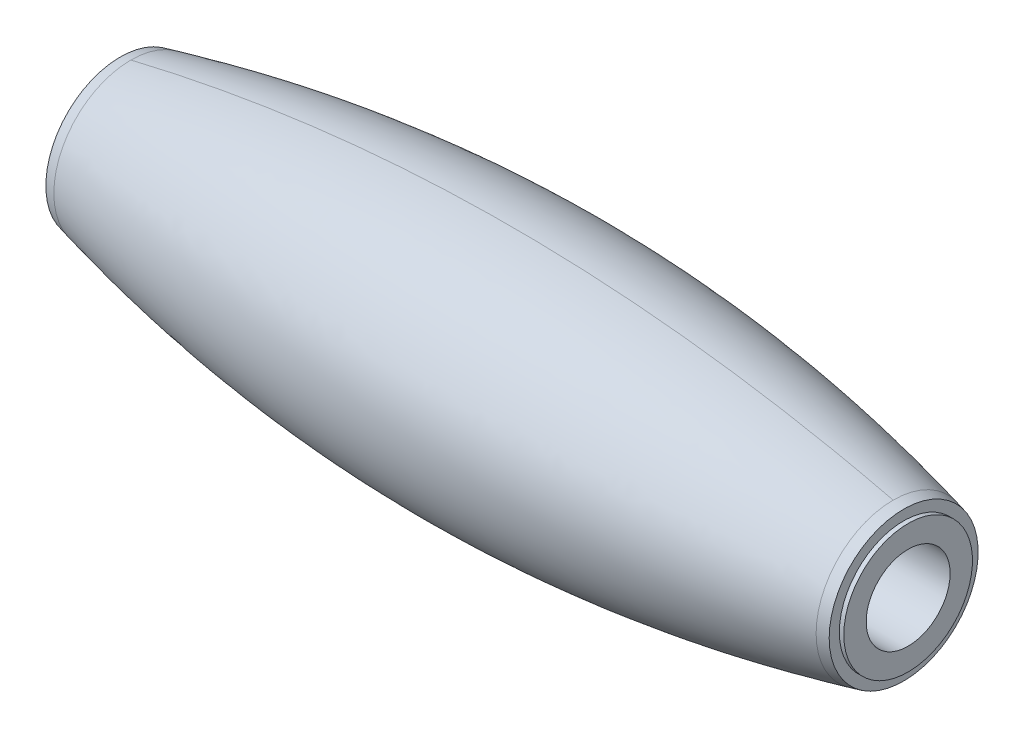
ISO-10303-21;
HEADER;
FILE_DESCRIPTION(('STEP AP214'),'2;1');
FILE_NAME('part.step','',(''),(''),'','','');
FILE_SCHEMA(('AUTOMOTIVE_DESIGN { 1 0 10303 214 1 1 1 1 }'));
ENDSEC;
DATA;
#1=APPLICATION_CONTEXT('core data for automotive mechanical design processes');
#2=APPLICATION_PROTOCOL_DEFINITION('international standard','automotive_design',2000,#1);
#3=PRODUCT_CONTEXT('',#1,'mechanical');
#4=PRODUCT('Part','Part','',(#3));
#5=PRODUCT_RELATED_PRODUCT_CATEGORY('part','',(#4));
#6=PRODUCT_DEFINITION_FORMATION('','',#4);
#7=PRODUCT_DEFINITION_CONTEXT('part definition',#1,'design');
#8=PRODUCT_DEFINITION('design','',#6,#7);
#9=PRODUCT_DEFINITION_SHAPE('','',#8);
#10=(LENGTH_UNIT() NAMED_UNIT(*) SI_UNIT(.MILLI.,.METRE.));
#11=(NAMED_UNIT(*) PLANE_ANGLE_UNIT() SI_UNIT($,.RADIAN.));
#12=(NAMED_UNIT(*) SI_UNIT($,.STERADIAN.) SOLID_ANGLE_UNIT());
#13=UNCERTAINTY_MEASURE_WITH_UNIT(LENGTH_MEASURE(1.E-05),#10,'distance_accuracy_value','');
#14=(GEOMETRIC_REPRESENTATION_CONTEXT(3) GLOBAL_UNCERTAINTY_ASSIGNED_CONTEXT((#13)) GLOBAL_UNIT_ASSIGNED_CONTEXT((#10,
#11,#12)) REPRESENTATION_CONTEXT('',''));
#15=CARTESIAN_POINT('',(0.,0.,0.));
#16=DIRECTION('',(0.,0.,1.));
#17=DIRECTION('',(1.,0.,0.));
#18=AXIS2_PLACEMENT_3D('',#15,#16,#17);
#19=CARTESIAN_POINT('',(0.,0.,0.));
#20=DIRECTION('',(1.,0.,0.));
#21=DIRECTION('',(0.,0.,-1.));
#22=AXIS2_PLACEMENT_3D('',#19,#20,#21);
#23=CYLINDRICAL_SURFACE('',#22,2.38125);
#24=CARTESIAN_POINT('',(22.479,0.,0.));
#25=DIRECTION('',(1.,0.,0.));
#26=DIRECTION('',(0.,0.,-1.));
#27=AXIS2_PLACEMENT_3D('',#24,#25,#26);
#28=CIRCLE('',#27,2.38125);
#29=CARTESIAN_POINT('',(22.479,0.,-2.38125));
#30=VERTEX_POINT('',#29);
#31=EDGE_CURVE('E85',#30,#30,#28,.F.);
#32=ORIENTED_EDGE('',*,*,#31,.F.);
#33=EDGE_LOOP('',(#32));
#34=FACE_BOUND('',#33,.T.);
#35=CARTESIAN_POINT('',(-22.4790000000034,0.,0.));
#36=DIRECTION('',(1.,0.,0.));
#37=DIRECTION('',(0.,0.,-1.));
#38=AXIS2_PLACEMENT_3D('',#35,#36,#37);
#39=CIRCLE('',#38,2.38125);
#40=CARTESIAN_POINT('',(-22.4790000000034,0.,-2.38125));
#41=VERTEX_POINT('',#40);
#42=EDGE_CURVE('E19',#41,#41,#39,.T.);
#43=ORIENTED_EDGE('',*,*,#42,.F.);
#44=EDGE_LOOP('',(#43));
#45=FACE_BOUND('',#44,.T.);
#46=ADVANCED_FACE('F16',(#34,#45),#23,.F.);
#47=CARTESIAN_POINT('',(-22.4790000000034,0.,0.));
#48=DIRECTION('',(-1.,0.,0.));
#49=DIRECTION('',(0.,0.,1.));
#50=AXIS2_PLACEMENT_3D('',#47,#48,#49);
#51=PLANE('',#50);
#52=ORIENTED_EDGE('',*,*,#42,.T.);
#53=EDGE_LOOP('',(#52));
#54=FACE_BOUND('',#53,.T.);
#55=CARTESIAN_POINT('',(-22.4790000000034,0.,0.));
#56=DIRECTION('',(1.,0.,0.));
#57=DIRECTION('',(0.,0.,-1.));
#58=AXIS2_PLACEMENT_3D('',#55,#56,#57);
#59=CIRCLE('',#58,3.65125);
#60=CARTESIAN_POINT('',(-22.4790000000034,0.,-3.65125));
#61=VERTEX_POINT('',#60);
#62=EDGE_CURVE('E83',#61,#61,#59,.T.);
#63=ORIENTED_EDGE('',*,*,#62,.F.);
#64=EDGE_LOOP('',(#63));
#65=FACE_BOUND('',#64,.T.);
#66=ADVANCED_FACE('F92',(#54,#65),#51,.T.);
#67=CARTESIAN_POINT('',(22.479,0.,0.));
#68=DIRECTION('',(1.,0.,0.));
#69=DIRECTION('',(0.,0.,-1.));
#70=AXIS2_PLACEMENT_3D('',#67,#68,#69);
#71=PLANE('',#70);
#72=ORIENTED_EDGE('',*,*,#31,.T.);
#73=EDGE_LOOP('',(#72));
#74=FACE_BOUND('',#73,.T.);
#75=CARTESIAN_POINT('',(22.479,0.,0.));
#76=DIRECTION('',(-1.,0.,0.));
#77=DIRECTION('',(0.,0.,1.));
#78=AXIS2_PLACEMENT_3D('',#75,#76,#77);
#79=CIRCLE('',#78,3.65125);
#80=CARTESIAN_POINT('',(22.479,0.,3.65125));
#81=VERTEX_POINT('',#80);
#82=EDGE_CURVE('E80',#81,#81,#79,.T.);
#83=ORIENTED_EDGE('',*,*,#82,.F.);
#84=EDGE_LOOP('',(#83));
#85=FACE_BOUND('',#84,.T.);
#86=ADVANCED_FACE('F101',(#74,#85),#71,.T.);
#87=CARTESIAN_POINT('',(-22.4790000000034,0.,0.));
#88=DIRECTION('',(1.,0.,0.));
#89=DIRECTION('',(0.,0.,-1.));
#90=AXIS2_PLACEMENT_3D('',#87,#88,#89);
#91=CYLINDRICAL_SURFACE('',#90,3.65125);
#92=CARTESIAN_POINT('',(-22.2250000000034,0.,0.));
#93=DIRECTION('',(1.,0.,0.));
#94=DIRECTION('',(0.,0.,-1.));
#95=AXIS2_PLACEMENT_3D('',#92,#93,#94);
#96=CIRCLE('',#95,3.65125);
#97=CARTESIAN_POINT('',(-22.2250000000034,0.,-3.65125));
#98=VERTEX_POINT('',#97);
#99=EDGE_CURVE('E77',#98,#98,#96,.T.);
#100=ORIENTED_EDGE('',*,*,#99,.F.);
#101=EDGE_LOOP('',(#100));
#102=FACE_BOUND('',#101,.T.);
#103=ORIENTED_EDGE('',*,*,#62,.T.);
#104=EDGE_LOOP('',(#103));
#105=FACE_BOUND('',#104,.T.);
#106=ADVANCED_FACE('F140',(#102,#105),#91,.T.);
#107=CARTESIAN_POINT('',(22.479,0.,0.));
#108=DIRECTION('',(-1.,0.,0.));
#109=DIRECTION('',(0.,0.,1.));
#110=AXIS2_PLACEMENT_3D('',#107,#108,#109);
#111=CYLINDRICAL_SURFACE('',#110,3.65125);
#112=CARTESIAN_POINT('',(22.225,0.,0.));
#113=DIRECTION('',(-1.,0.,0.));
#114=DIRECTION('',(0.,0.,1.));
#115=AXIS2_PLACEMENT_3D('',#112,#113,#114);
#116=CIRCLE('',#115,3.65125);
#117=CARTESIAN_POINT('',(22.225,0.,3.65125));
#118=VERTEX_POINT('',#117);
#119=EDGE_CURVE('E74',#118,#118,#116,.T.);
#120=ORIENTED_EDGE('',*,*,#119,.F.);
#121=EDGE_LOOP('',(#120));
#122=FACE_BOUND('',#121,.T.);
#123=ORIENTED_EDGE('',*,*,#82,.T.);
#124=EDGE_LOOP('',(#123));
#125=FACE_BOUND('',#124,.T.);
#126=ADVANCED_FACE('F136',(#122,#125),#111,.T.);
#127=CARTESIAN_POINT('',(-22.2250000000034,2.38125,0.));
#128=DIRECTION('',(-1.,0.,0.));
#129=DIRECTION('',(0.,0.,1.));
#130=AXIS2_PLACEMENT_3D('',#127,#128,#129);
#131=PLANE('',#130);
#132=ORIENTED_EDGE('',*,*,#99,.T.);
#133=EDGE_LOOP('',(#132));
#134=FACE_BOUND('',#133,.T.);
#135=CARTESIAN_POINT('',(-22.2249999999917,0.,0.));
#136=DIRECTION('',(1.,0.,0.));
#137=DIRECTION('',(0.,0.,-1.));
#138=AXIS2_PLACEMENT_3D('',#135,#136,#137);
#139=CIRCLE('',#138,4.22655856244964);
#140=CARTESIAN_POINT('',(-22.2249999999917,0.,-4.22655856244964));
#141=VERTEX_POINT('',#140);
#142=EDGE_CURVE('E71',#141,#141,#139,.T.);
#143=ORIENTED_EDGE('',*,*,#142,.F.);
#144=EDGE_LOOP('',(#143));
#145=FACE_BOUND('',#144,.T.);
#146=ADVANCED_FACE('F132',(#134,#145),#131,.T.);
#147=CARTESIAN_POINT('',(22.225,2.38125,0.));
#148=DIRECTION('',(1.,0.,0.));
#149=DIRECTION('',(0.,0.,-1.));
#150=AXIS2_PLACEMENT_3D('',#147,#148,#149);
#151=PLANE('',#150);
#152=ORIENTED_EDGE('',*,*,#119,.T.);
#153=EDGE_LOOP('',(#152));
#154=FACE_BOUND('',#153,.T.);
#155=CARTESIAN_POINT('',(22.2250000000486,0.,0.));
#156=DIRECTION('',(-1.,0.,0.));
#157=DIRECTION('',(0.,0.,1.));
#158=AXIS2_PLACEMENT_3D('',#155,#156,#157);
#159=CIRCLE('',#158,4.22655856246385);
#160=CARTESIAN_POINT('',(22.2250000000486,0.,4.22655856246385));
#161=VERTEX_POINT('',#160);
#162=EDGE_CURVE('E47',#161,#161,#159,.T.);
#163=ORIENTED_EDGE('',*,*,#162,.F.);
#164=EDGE_LOOP('',(#163));
#165=FACE_BOUND('',#164,.T.);
#166=ADVANCED_FACE('F128',(#154,#165),#151,.T.);
#167=CARTESIAN_POINT('',(-21.6280284818708,0.,0.));
#168=DIRECTION('',(1.,0.,0.));
#169=DIRECTION('',(0.,0.,-1.));
#170=AXIS2_PLACEMENT_3D('',#167,#168,#169);
#171=CONICAL_SURFACE('',#170,4.37090708773269,0.237247536257771);
#172=ORIENTED_EDGE('',*,*,#142,.T.);
#173=EDGE_LOOP('',(#172));
#174=FACE_BOUND('',#173,.T.);
#175=CARTESIAN_POINT('',(-21.6280284816593,0.,0.));
#176=DIRECTION('',(1.,0.,0.));
#177=DIRECTION('',(0.,0.,-1.));
#178=AXIS2_PLACEMENT_3D('',#175,#176,#177);
#179=CIRCLE('',#178,4.37090708779612);
#180=CARTESIAN_POINT('',(-21.6280284818708,-4.37090708773269,0.));
#181=VERTEX_POINT('',#180);
#182=CARTESIAN_POINT('',(-21.6280284816901,4.37090708779118,0.));
#183=VERTEX_POINT('',#182);
#184=EDGE_CURVE('E54',#181,#183,#179,.T.);
#185=ORIENTED_EDGE('',*,*,#184,.F.);
#186=CARTESIAN_POINT('',(-21.6280284816593,0.,0.));
#187=DIRECTION('',(1.,0.,0.));
#188=DIRECTION('',(0.,0.,-1.));
#189=AXIS2_PLACEMENT_3D('',#186,#187,#188);
#190=CIRCLE('',#189,4.37090708779612);
#191=EDGE_CURVE('E40',#183,#181,#190,.T.);
#192=ORIENTED_EDGE('',*,*,#191,.F.);
#193=EDGE_LOOP('',(#185,#192));
#194=FACE_BOUND('',#193,.T.);
#195=ADVANCED_FACE('F120',(#174,#194),#171,.T.);
#196=CARTESIAN_POINT('',(-21.6280284816593,-4.37090708779611,0.));
#197=CARTESIAN_POINT('',(-21.6280284816593,-4.37090708779611,8.74181417559223));
#198=CARTESIAN_POINT('',(-21.6280284816593,4.37090708779612,8.74181417559223));
#199=CARTESIAN_POINT('',(-21.6280284816593,4.37090708779612,0.));
#200=CARTESIAN_POINT('',(-18.090494464724,-5.22628762606418,0.));
#201=CARTESIAN_POINT('',(-18.090494464724,-5.22628762606418,10.4525752521284));
#202=CARTESIAN_POINT('',(-18.090494464724,5.22628762606418,10.4525752521284));
#203=CARTESIAN_POINT('',(-18.090494464724,5.22628762606419,0.));
#204=CARTESIAN_POINT('',(-10.9078349316213,-6.54056481136885,0.));
#205=CARTESIAN_POINT('',(-10.9078349316213,-6.54056481136885,13.0811296227377));
#206=CARTESIAN_POINT('',(-10.9078349316213,6.54056481136885,13.0811296227377));
#207=CARTESIAN_POINT('',(-10.9078349316213,6.54056481136885,0.));
#208=CARTESIAN_POINT('',(-3.44932167639718E-12,-7.20721759431536,0.));
#209=CARTESIAN_POINT('',(-3.44932167639718E-12,-7.20721759431537,14.4144351886307));
#210=CARTESIAN_POINT('',(-3.4481965893729E-12,7.20721759431536,14.4144351886307));
#211=CARTESIAN_POINT('',(-3.4481965893729E-12,7.20721759431536,0.));
#212=CARTESIAN_POINT('',(10.9078349316145,-6.54056481136969,0.));
#213=CARTESIAN_POINT('',(10.9078349316145,-6.54056481136969,13.0811296227394));
#214=CARTESIAN_POINT('',(10.9078349316145,6.54056481136969,13.0811296227394));
#215=CARTESIAN_POINT('',(10.9078349316145,6.54056481136969,0.));
#216=CARTESIAN_POINT('',(18.0904944647173,-5.22628762606555,0.));
#217=CARTESIAN_POINT('',(18.0904944647173,-5.22628762606555,10.4525752521311));
#218=CARTESIAN_POINT('',(18.0904944647173,5.22628762606554,10.4525752521311));
#219=CARTESIAN_POINT('',(18.0904944647173,5.22628762606555,0.));
#220=CARTESIAN_POINT('',(21.6280284816526,-4.37090708779774,0.));
#221=CARTESIAN_POINT('',(21.6280284816526,-4.37090708779774,8.74181417559548));
#222=CARTESIAN_POINT('',(21.6280284816526,4.37090708779774,8.74181417559548));
#223=CARTESIAN_POINT('',(21.6280284816526,4.37090708779774,0.));
#224=(BOUNDED_SURFACE() B_SPLINE_SURFACE(3,3,((#196,#197,#198,#199),(#200,#201,#202,#203),(#204,
#205,#206,#207),(#208,#209,#210,#211),(#212,#213,#214,#215),(#216,#217,#218,#219),(#220,#221,
#222,#223)),.UNSPECIFIED.,.F.,.F.,.F.) B_SPLINE_SURFACE_WITH_KNOTS((4,1,1,1,4),(4,4),
(0.18506105588484,0.342530527942445,0.50000000000005,0.657469472057654,0.814938944115259),(0.,
1.),.UNSPECIFIED.) GEOMETRIC_REPRESENTATION_ITEM() RATIONAL_B_SPLINE_SURFACE(((1.,
0.333333333333333,0.333333333333333,1.),(1.,0.333333333333333,0.333333333333333,1.),(1.,
0.333333333333333,0.333333333333333,1.),(1.,0.333333333333333,0.333333333333333,1.),(1.,
0.333333333333333,0.333333333333333,1.),(1.,0.333333333333333,0.333333333333333,1.),(1.,
0.333333333333333,0.333333333333333,1.))) REPRESENTATION_ITEM('') SURFACE());
#225=CARTESIAN_POINT('',(21.6280284816526,0.,0.));
#226=DIRECTION('',(-1.,0.,0.));
#227=DIRECTION('',(0.,0.,1.));
#228=AXIS2_PLACEMENT_3D('',#225,#226,#227);
#229=CIRCLE('',#228,4.37090708779774);
#230=CARTESIAN_POINT('',(21.6280284817333,-4.37090708778653,0.));
#231=VERTEX_POINT('',#230);
#232=CARTESIAN_POINT('',(21.6280284817064,4.37090708779027,0.));
#233=VERTEX_POINT('',#232);
#234=EDGE_CURVE('E32',#231,#233,#229,.T.);
#235=CARTESIAN_POINT('',(-21.6280284816593,4.37090708779612,0.));
#236=CARTESIAN_POINT('',(-18.090494464724,5.22628762606419,0.));
#237=CARTESIAN_POINT('',(-10.9078349316213,6.54056481136885,0.));
#238=CARTESIAN_POINT('',(-3.4481965893729E-12,7.20721759431536,0.));
#239=CARTESIAN_POINT('',(10.9078349316145,6.54056481136969,0.));
#240=CARTESIAN_POINT('',(18.0904944647173,5.22628762606555,0.));
#241=CARTESIAN_POINT('',(21.6280284816526,4.37090708779774,0.));
#242=B_SPLINE_CURVE_WITH_KNOTS('',3,(#235,#236,#237,#238,#239,#240,#241),.UNSPECIFIED.,.F.,.F.,
(4,1,1,1,4),(0.18506105588484,0.342530527942445,0.50000000000005,0.657469472057654,
0.814938944115259),.UNSPECIFIED.);
#243=EDGE_CURVE('E24',#183,#233,#242,.T.);
#244=CARTESIAN_POINT('',(-21.6280284816593,-4.37090708779611,0.));
#245=CARTESIAN_POINT('',(-18.090494464724,-5.22628762606418,0.));
#246=CARTESIAN_POINT('',(-10.9078349316213,-6.54056481136885,0.));
#247=CARTESIAN_POINT('',(-3.44932167639718E-12,-7.20721759431536,0.));
#248=CARTESIAN_POINT('',(10.9078349316145,-6.54056481136969,0.));
#249=CARTESIAN_POINT('',(18.0904944647173,-5.22628762606555,0.));
#250=CARTESIAN_POINT('',(21.6280284816526,-4.37090708779774,0.));
#251=B_SPLINE_CURVE_WITH_KNOTS('',3,(#244,#245,#246,#247,#248,#249,#250),.UNSPECIFIED.,.F.,.F.,
(4,1,1,1,4),(0.18506105588484,0.342530527942445,0.50000000000005,0.657469472057654,
0.814938944115259),.UNSPECIFIED.);
#252=EDGE_CURVE('E50',#231,#181,#251,.F.);
#253=ORIENTED_EDGE('',*,*,#234,.T.);
#254=ORIENTED_EDGE('',*,*,#243,.F.);
#255=ORIENTED_EDGE('',*,*,#191,.T.);
#256=ORIENTED_EDGE('',*,*,#252,.F.);
#257=EDGE_LOOP('',(#253,#254,#255,#256));
#258=FACE_BOUND('',#257,.T.);
#259=ADVANCED_FACE('F51',(#258),#224,.T.);
#260=CARTESIAN_POINT('',(21.628028481814,0.,0.));
#261=DIRECTION('',(-1.,0.,0.));
#262=DIRECTION('',(0.,0.,1.));
#263=AXIS2_PLACEMENT_3D('',#260,#261,#262);
#264=CONICAL_SURFACE('',#263,4.37090708777532,0.237247536259246);
#265=CARTESIAN_POINT('',(21.6280284816526,0.,0.));
#266=DIRECTION('',(-1.,0.,0.));
#267=DIRECTION('',(0.,0.,1.));
#268=AXIS2_PLACEMENT_3D('',#265,#266,#267);
#269=CIRCLE('',#268,4.37090708779774);
#270=EDGE_CURVE('E11',#233,#231,#269,.T.);
#271=ORIENTED_EDGE('',*,*,#270,.F.);
#272=ORIENTED_EDGE('',*,*,#234,.F.);
#273=EDGE_LOOP('',(#271,#272));
#274=FACE_BOUND('',#273,.T.);
#275=ORIENTED_EDGE('',*,*,#162,.T.);
#276=EDGE_LOOP('',(#275));
#277=FACE_BOUND('',#276,.T.);
#278=ADVANCED_FACE('F44',(#274,#277),#264,.T.);
#279=CARTESIAN_POINT('',(-21.6280284816593,4.37090708779612,0.));
#280=CARTESIAN_POINT('',(-21.6280284816593,4.37090708779612,-8.74181417559223));
#281=CARTESIAN_POINT('',(-21.6280284816593,-4.37090708779611,-8.74181417559223));
#282=CARTESIAN_POINT('',(-21.6280284816593,-4.37090708779611,0.));
#283=CARTESIAN_POINT('',(-18.090494464724,5.22628762606419,0.));
#284=CARTESIAN_POINT('',(-18.090494464724,5.22628762606419,-10.4525752521284));
#285=CARTESIAN_POINT('',(-18.090494464724,-5.22628762606418,-10.4525752521284));
#286=CARTESIAN_POINT('',(-18.090494464724,-5.22628762606418,0.));
#287=CARTESIAN_POINT('',(-10.9078349316213,6.54056481136885,0.));
#288=CARTESIAN_POINT('',(-10.9078349316213,6.54056481136885,-13.0811296227377));
#289=CARTESIAN_POINT('',(-10.9078349316213,-6.54056481136884,-13.0811296227377));
#290=CARTESIAN_POINT('',(-10.9078349316213,-6.54056481136885,0.));
#291=CARTESIAN_POINT('',(-3.4481965893729E-12,7.20721759431536,0.));
#292=CARTESIAN_POINT('',(-3.4481965893729E-12,7.20721759431537,-14.4144351886307));
#293=CARTESIAN_POINT('',(-3.44932167639718E-12,-7.20721759431536,-14.4144351886307));
#294=CARTESIAN_POINT('',(-3.44932167639718E-12,-7.20721759431536,0.));
#295=CARTESIAN_POINT('',(10.9078349316145,6.54056481136969,0.));
#296=CARTESIAN_POINT('',(10.9078349316145,6.54056481136969,-13.0811296227394));
#297=CARTESIAN_POINT('',(10.9078349316145,-6.54056481136969,-13.0811296227394));
#298=CARTESIAN_POINT('',(10.9078349316145,-6.54056481136969,0.));
#299=CARTESIAN_POINT('',(18.0904944647173,5.22628762606555,0.));
#300=CARTESIAN_POINT('',(18.0904944647173,5.22628762606555,-10.4525752521311));
#301=CARTESIAN_POINT('',(18.0904944647173,-5.22628762606555,-10.4525752521311));
#302=CARTESIAN_POINT('',(18.0904944647173,-5.22628762606555,0.));
#303=CARTESIAN_POINT('',(21.6280284816526,4.37090708779774,0.));
#304=CARTESIAN_POINT('',(21.6280284816526,4.37090708779774,-8.74181417559548));
#305=CARTESIAN_POINT('',(21.6280284816526,-4.37090708779774,-8.74181417559548));
#306=CARTESIAN_POINT('',(21.6280284816526,-4.37090708779774,0.));
#307=(BOUNDED_SURFACE() B_SPLINE_SURFACE(3,3,((#279,#280,#281,#282),(#283,#284,#285,#286),(#287,
#288,#289,#290),(#291,#292,#293,#294),(#295,#296,#297,#298),(#299,#300,#301,#302),(#303,#304,
#305,#306)),.UNSPECIFIED.,.F.,.F.,.F.) B_SPLINE_SURFACE_WITH_KNOTS((4,1,1,1,4),(4,4),
(0.18506105588484,0.342530527942445,0.50000000000005,0.657469472057654,0.814938944115259),(0.,
1.),.UNSPECIFIED.) GEOMETRIC_REPRESENTATION_ITEM() RATIONAL_B_SPLINE_SURFACE(((1.,
0.333333333333333,0.333333333333333,1.),(1.,0.333333333333333,0.333333333333333,1.),(1.,
0.333333333333333,0.333333333333333,1.),(1.,0.333333333333333,0.333333333333333,1.),(1.,
0.333333333333333,0.333333333333333,1.),(1.,0.333333333333333,0.333333333333333,1.),(1.,
0.333333333333333,0.333333333333333,1.))) REPRESENTATION_ITEM('') SURFACE());
#308=ORIENTED_EDGE('',*,*,#243,.T.);
#309=ORIENTED_EDGE('',*,*,#270,.T.);
#310=ORIENTED_EDGE('',*,*,#252,.T.);
#311=ORIENTED_EDGE('',*,*,#184,.T.);
#312=EDGE_LOOP('',(#308,#309,#310,#311));
#313=FACE_BOUND('',#312,.T.);
#314=ADVANCED_FACE('F56',(#313),#307,.T.);
#315=CLOSED_SHELL('',(#46,#66,#86,#106,#126,#146,#166,#195,#259,#278,#314));
#316=MANIFOLD_SOLID_BREP('B1',#315);
#317=ADVANCED_BREP_SHAPE_REPRESENTATION('',(#18,#316),#14);
#318=SHAPE_DEFINITION_REPRESENTATION(#9,#317);
ENDSEC;
END-ISO-10303-21;
